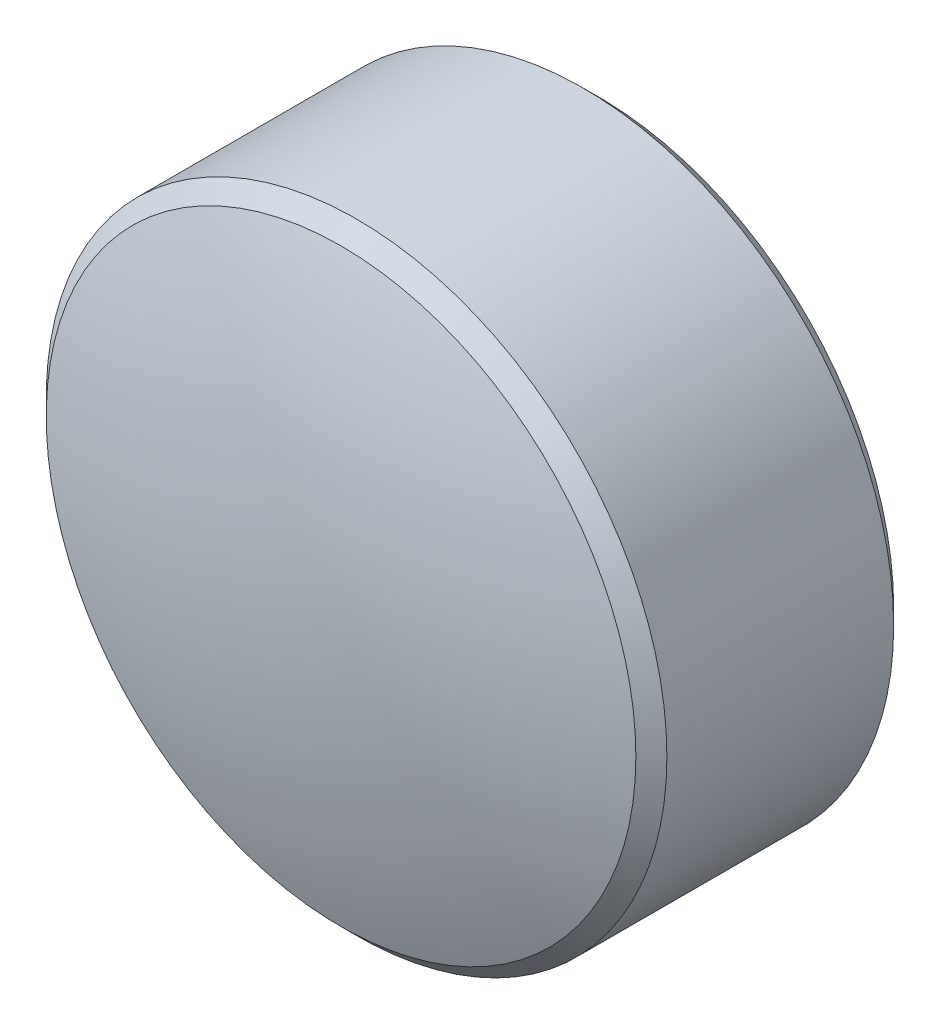
ISO-10303-21;
HEADER;
FILE_DESCRIPTION(('STEP AP214'),'2;1');
FILE_NAME('part.step','',(''),(''),'','','');
FILE_SCHEMA(('AUTOMOTIVE_DESIGN { 1 0 10303 214 1 1 1 1 }'));
ENDSEC;
DATA;
#1=APPLICATION_CONTEXT('core data for automotive mechanical design processes');
#2=APPLICATION_PROTOCOL_DEFINITION('international standard','automotive_design',2000,#1);
#3=PRODUCT_CONTEXT('',#1,'mechanical');
#4=PRODUCT('Part','Part','',(#3));
#5=PRODUCT_RELATED_PRODUCT_CATEGORY('part','',(#4));
#6=PRODUCT_DEFINITION_FORMATION('','',#4);
#7=PRODUCT_DEFINITION_CONTEXT('part definition',#1,'design');
#8=PRODUCT_DEFINITION('design','',#6,#7);
#9=PRODUCT_DEFINITION_SHAPE('','',#8);
#10=(LENGTH_UNIT() NAMED_UNIT(*) SI_UNIT(.MILLI.,.METRE.));
#11=(NAMED_UNIT(*) PLANE_ANGLE_UNIT() SI_UNIT($,.RADIAN.));
#12=(NAMED_UNIT(*) SI_UNIT($,.STERADIAN.) SOLID_ANGLE_UNIT());
#13=UNCERTAINTY_MEASURE_WITH_UNIT(LENGTH_MEASURE(1.E-05),#10,'distance_accuracy_value','');
#14=(GEOMETRIC_REPRESENTATION_CONTEXT(3) GLOBAL_UNCERTAINTY_ASSIGNED_CONTEXT((#13)) GLOBAL_UNIT_ASSIGNED_CONTEXT((#10,
#11,#12)) REPRESENTATION_CONTEXT('',''));
#15=CARTESIAN_POINT('',(0.,0.,0.));
#16=DIRECTION('',(0.,0.,1.));
#17=DIRECTION('',(1.,0.,0.));
#18=AXIS2_PLACEMENT_3D('',#15,#16,#17);
#19=CARTESIAN_POINT('',(0.73521296224847,0.941459341422047,1.11061879664917));
#20=DIRECTION('',(0.,0.,1.));
#21=DIRECTION('',(1.,0.,0.));
#22=AXIS2_PLACEMENT_3D('',#19,#20,#21);
#23=PLANE('',#22);
#24=CARTESIAN_POINT('',(0.73521296224847,0.941459341422047,1.11061879664917));
#25=DIRECTION('',(0.,0.,1.));
#26=DIRECTION('',(1.,0.,0.));
#27=AXIS2_PLACEMENT_3D('',#24,#25,#26);
#28=CIRCLE('',#27,0.95);
#29=CARTESIAN_POINT('',(1.68521296224847,0.941459341422047,1.11061879664917));
#30=VERTEX_POINT('',#29);
#31=EDGE_CURVE('E9',#30,#30,#28,.F.);
#32=ORIENTED_EDGE('',*,*,#31,.T.);
#33=EDGE_LOOP('',(#32));
#34=FACE_BOUND('',#33,.T.);
#35=ADVANCED_FACE('F13',(#34),#23,.F.);
#36=CARTESIAN_POINT('',(0.73521296224847,0.941459341422047,2.11061879664917));
#37=DIRECTION('',(0.,0.,1.));
#38=DIRECTION('',(1.,0.,0.));
#39=AXIS2_PLACEMENT_3D('',#36,#37,#38);
#40=CYLINDRICAL_SURFACE('',#39,1.);
#41=CARTESIAN_POINT('',(0.73521296224847,0.941459341422047,1.16061879664917));
#42=DIRECTION('',(0.,0.,1.));
#43=DIRECTION('',(1.,0.,0.));
#44=AXIS2_PLACEMENT_3D('',#41,#42,#43);
#45=CIRCLE('',#44,1.);
#46=CARTESIAN_POINT('',(1.73521296224847,0.941459341422047,1.16061879664917));
#47=VERTEX_POINT('',#46);
#48=EDGE_CURVE('E20',#47,#47,#45,.T.);
#49=ORIENTED_EDGE('',*,*,#48,.T.);
#50=EDGE_LOOP('',(#49));
#51=FACE_BOUND('',#50,.T.);
#52=CARTESIAN_POINT('',(0.73521296224847,0.941459341422047,1.89138195387332));
#53=DIRECTION('',(0.,0.,1.));
#54=DIRECTION('',(1.,0.,0.));
#55=AXIS2_PLACEMENT_3D('',#52,#53,#54);
#56=CIRCLE('',#55,1.);
#57=CARTESIAN_POINT('',(1.73521296224847,0.941459341422047,1.89138195387332));
#58=VERTEX_POINT('',#57);
#59=EDGE_CURVE('E24',#58,#58,#56,.T.);
#60=ORIENTED_EDGE('',*,*,#59,.F.);
#61=EDGE_LOOP('',(#60));
#62=FACE_BOUND('',#61,.T.);
#63=ADVANCED_FACE('F39',(#51,#62),#40,.T.);
#64=CARTESIAN_POINT('',(0.73521296224847,0.941459341422047,1.89138195387332));
#65=DIRECTION('',(0.,0.,-1.));
#66=DIRECTION('',(-1.,0.,0.));
#67=AXIS2_PLACEMENT_3D('',#64,#65,#66);
#68=CONICAL_SURFACE('',#67,1.,0.785398163397447);
#69=CARTESIAN_POINT('',(0.73521296224847,0.941459341422047,1.94138195387332));
#70=DIRECTION('',(0.,0.,1.));
#71=DIRECTION('',(1.,0.,0.));
#72=AXIS2_PLACEMENT_3D('',#69,#70,#71);
#73=CIRCLE('',#72,0.95);
#74=CARTESIAN_POINT('',(1.68521296224847,0.941459341422047,1.94138195387332));
#75=VERTEX_POINT('',#74);
#76=EDGE_CURVE('E28',#75,#75,#73,.T.);
#77=ORIENTED_EDGE('',*,*,#76,.F.);
#78=EDGE_LOOP('',(#77));
#79=FACE_BOUND('',#78,.T.);
#80=ORIENTED_EDGE('',*,*,#59,.T.);
#81=EDGE_LOOP('',(#80));
#82=FACE_BOUND('',#81,.T.);
#83=ADVANCED_FACE('F36',(#79,#82),#68,.T.);
#84=CARTESIAN_POINT('',(0.73521296224847,0.941459341422047,-0.640381203350831));
#85=DIRECTION('',(0.,0.,1.));
#86=DIRECTION('',(0.,1.,0.));
#87=AXIS2_PLACEMENT_3D('',#84,#85,#86);
#88=SPHERICAL_SURFACE('',#87,2.751);
#89=ORIENTED_EDGE('',*,*,#76,.T.);
#90=EDGE_LOOP('',(#89));
#91=FACE_BOUND('',#90,.T.);
#92=ADVANCED_FACE('F34',(#91),#88,.T.);
#93=CARTESIAN_POINT('',(0.73521296224847,0.941459341422047,1.16061879664917));
#94=DIRECTION('',(0.,0.,1.));
#95=DIRECTION('',(1.,0.,0.));
#96=AXIS2_PLACEMENT_3D('',#93,#94,#95);
#97=CONICAL_SURFACE('',#96,1.,0.785398163397444);
#98=ORIENTED_EDGE('',*,*,#31,.F.);
#99=EDGE_LOOP('',(#98));
#100=FACE_BOUND('',#99,.T.);
#101=ORIENTED_EDGE('',*,*,#48,.F.);
#102=EDGE_LOOP('',(#101));
#103=FACE_BOUND('',#102,.T.);
#104=ADVANCED_FACE('F15',(#100,#103),#97,.T.);
#105=CLOSED_SHELL('',(#35,#63,#83,#92,#104));
#106=MANIFOLD_SOLID_BREP('B1',#105);
#107=ADVANCED_BREP_SHAPE_REPRESENTATION('',(#18,#106),#14);
#108=SHAPE_DEFINITION_REPRESENTATION(#9,#107);
ENDSEC;
END-ISO-10303-21;
